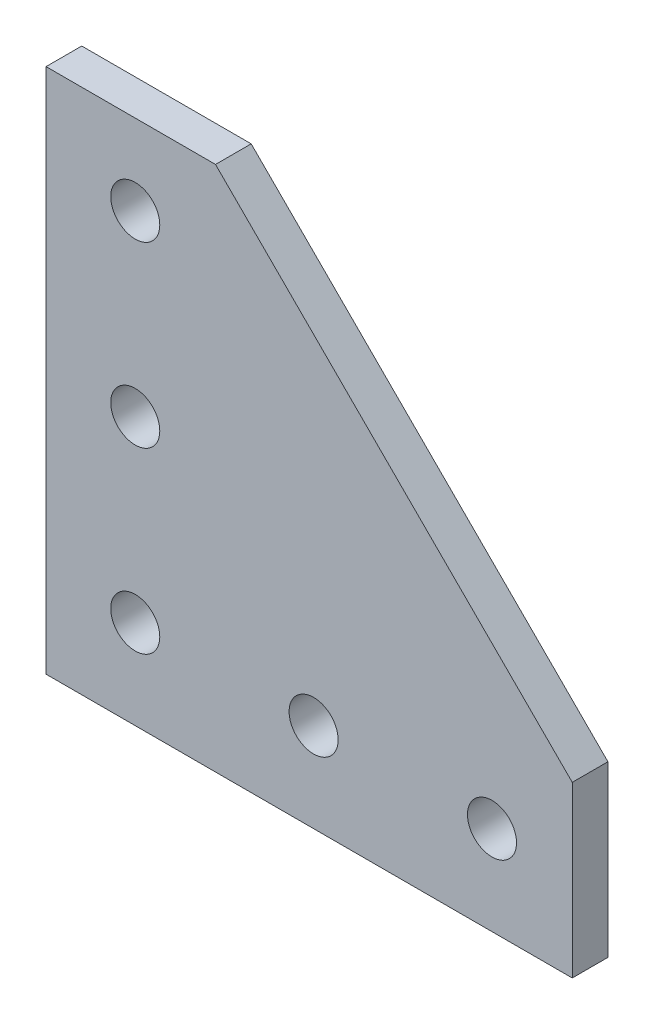
ISO-10303-21;
HEADER;
FILE_DESCRIPTION(('STEP AP214'),'2;1');
FILE_NAME('part.step','',(''),(''),'','','');
FILE_SCHEMA(('AUTOMOTIVE_DESIGN { 1 0 10303 214 1 1 1 1 }'));
ENDSEC;
DATA;
#1=APPLICATION_CONTEXT('core data for automotive mechanical design processes');
#2=APPLICATION_PROTOCOL_DEFINITION('international standard','automotive_design',2000,#1);
#3=PRODUCT_CONTEXT('',#1,'mechanical');
#4=PRODUCT('Part','Part','',(#3));
#5=PRODUCT_RELATED_PRODUCT_CATEGORY('part','',(#4));
#6=PRODUCT_DEFINITION_FORMATION('','',#4);
#7=PRODUCT_DEFINITION_CONTEXT('part definition',#1,'design');
#8=PRODUCT_DEFINITION('design','',#6,#7);
#9=PRODUCT_DEFINITION_SHAPE('','',#8);
#10=(LENGTH_UNIT() NAMED_UNIT(*) SI_UNIT(.MILLI.,.METRE.));
#11=(NAMED_UNIT(*) PLANE_ANGLE_UNIT() SI_UNIT($,.RADIAN.));
#12=(NAMED_UNIT(*) SI_UNIT($,.STERADIAN.) SOLID_ANGLE_UNIT());
#13=UNCERTAINTY_MEASURE_WITH_UNIT(LENGTH_MEASURE(1.E-05),#10,'distance_accuracy_value','');
#14=(GEOMETRIC_REPRESENTATION_CONTEXT(3) GLOBAL_UNCERTAINTY_ASSIGNED_CONTEXT((#13)) GLOBAL_UNIT_ASSIGNED_CONTEXT((#10,
#11,#12)) REPRESENTATION_CONTEXT('',''));
#15=CARTESIAN_POINT('',(0.,0.,0.));
#16=DIRECTION('',(0.,0.,1.));
#17=DIRECTION('',(1.,0.,0.));
#18=AXIS2_PLACEMENT_3D('',#15,#16,#17);
#19=CARTESIAN_POINT('',(0.,0.,2.));
#20=DIRECTION('',(0.,0.,-1.));
#21=DIRECTION('',(-1.,0.,0.));
#22=AXIS2_PLACEMENT_3D('',#19,#20,#21);
#23=PLANE('',#22);
#24=CARTESIAN_POINT('',(30.,9.99999999999999,2.));
#25=DIRECTION('',(0.,0.,1.));
#26=DIRECTION('',(1.,0.,0.));
#27=AXIS2_PLACEMENT_3D('',#24,#25,#26);
#28=CIRCLE('',#27,2.75);
#29=CARTESIAN_POINT('',(32.75,9.99999999999999,2.));
#30=VERTEX_POINT('',#29);
#31=EDGE_CURVE('E177',#30,#30,#28,.T.);
#32=ORIENTED_EDGE('',*,*,#31,.F.);
#33=EDGE_LOOP('',(#32));
#34=FACE_BOUND('',#33,.T.);
#35=CARTESIAN_POINT('',(10.,30.,2.));
#36=DIRECTION('',(0.,0.,1.));
#37=DIRECTION('',(1.,0.,0.));
#38=AXIS2_PLACEMENT_3D('',#35,#36,#37);
#39=CIRCLE('',#38,2.75);
#40=CARTESIAN_POINT('',(12.75,30.,2.));
#41=VERTEX_POINT('',#40);
#42=EDGE_CURVE('E189',#41,#41,#39,.T.);
#43=ORIENTED_EDGE('',*,*,#42,.F.);
#44=EDGE_LOOP('',(#43));
#45=FACE_BOUND('',#44,.T.);
#46=DIRECTION('',(1.,0.,0.));
#47=VECTOR('',#46,1.);
#48=CARTESIAN_POINT('',(59.,0.,2.));
#49=LINE('',#48,#47);
#50=CARTESIAN_POINT('',(0.,0.,2.));
#51=VERTEX_POINT('',#50);
#52=CARTESIAN_POINT('',(59.,0.,2.));
#53=VERTEX_POINT('',#52);
#54=EDGE_CURVE('E117',#51,#53,#49,.T.);
#55=ORIENTED_EDGE('',*,*,#54,.T.);
#56=DIRECTION('',(0.,1.,0.));
#57=VECTOR('',#56,1.);
#58=CARTESIAN_POINT('',(59.,19.,2.));
#59=LINE('',#58,#57);
#60=CARTESIAN_POINT('',(59.,19.,2.));
#61=VERTEX_POINT('',#60);
#62=EDGE_CURVE('E84',#53,#61,#59,.T.);
#63=ORIENTED_EDGE('',*,*,#62,.T.);
#64=DIRECTION('',(-0.707106781186548,0.707106781186548,0.));
#65=VECTOR('',#64,1.);
#66=CARTESIAN_POINT('',(19.,59.,2.));
#67=LINE('',#66,#65);
#68=CARTESIAN_POINT('',(19.,59.,2.));
#69=VERTEX_POINT('',#68);
#70=EDGE_CURVE('E88',#61,#69,#67,.T.);
#71=ORIENTED_EDGE('',*,*,#70,.T.);
#72=DIRECTION('',(-1.,0.,0.));
#73=VECTOR('',#72,1.);
#74=CARTESIAN_POINT('',(0.,59.,2.));
#75=LINE('',#74,#73);
#76=CARTESIAN_POINT('',(0.,59.,2.));
#77=VERTEX_POINT('',#76);
#78=EDGE_CURVE('E92',#69,#77,#75,.T.);
#79=ORIENTED_EDGE('',*,*,#78,.T.);
#80=DIRECTION('',(0.,-1.,0.));
#81=VECTOR('',#80,1.);
#82=CARTESIAN_POINT('',(0.,0.,2.));
#83=LINE('',#82,#81);
#84=EDGE_CURVE('E50',#77,#51,#83,.T.);
#85=ORIENTED_EDGE('',*,*,#84,.T.);
#86=EDGE_LOOP('',(#55,#63,#71,#79,#85));
#87=FACE_BOUND('',#86,.T.);
#88=CARTESIAN_POINT('',(10.,9.99999999999999,2.));
#89=DIRECTION('',(0.,0.,1.));
#90=DIRECTION('',(1.,0.,0.));
#91=AXIS2_PLACEMENT_3D('',#88,#89,#90);
#92=CIRCLE('',#91,2.75);
#93=CARTESIAN_POINT('',(12.75,9.99999999999999,2.));
#94=VERTEX_POINT('',#93);
#95=EDGE_CURVE('E112',#94,#94,#92,.T.);
#96=ORIENTED_EDGE('',*,*,#95,.F.);
#97=EDGE_LOOP('',(#96));
#98=FACE_BOUND('',#97,.T.);
#99=CARTESIAN_POINT('',(10.,50.,2.));
#100=DIRECTION('',(0.,0.,1.));
#101=DIRECTION('',(1.,0.,0.));
#102=AXIS2_PLACEMENT_3D('',#99,#100,#101);
#103=CIRCLE('',#102,2.75);
#104=CARTESIAN_POINT('',(12.75,50.,2.));
#105=VERTEX_POINT('',#104);
#106=EDGE_CURVE('E183',#105,#105,#103,.T.);
#107=ORIENTED_EDGE('',*,*,#106,.F.);
#108=EDGE_LOOP('',(#107));
#109=FACE_BOUND('',#108,.T.);
#110=CARTESIAN_POINT('',(50.,9.99999999999999,2.));
#111=DIRECTION('',(0.,0.,1.));
#112=DIRECTION('',(1.,0.,0.));
#113=AXIS2_PLACEMENT_3D('',#110,#111,#112);
#114=CIRCLE('',#113,2.75);
#115=CARTESIAN_POINT('',(52.75,9.99999999999999,2.));
#116=VERTEX_POINT('',#115);
#117=EDGE_CURVE('E168',#116,#116,#114,.T.);
#118=ORIENTED_EDGE('',*,*,#117,.F.);
#119=EDGE_LOOP('',(#118));
#120=FACE_BOUND('',#119,.T.);
#121=ADVANCED_FACE('F33',(#34,#45,#87,#98,#109,#120),#23,.F.);
#122=CARTESIAN_POINT('',(0.,0.,-2.));
#123=DIRECTION('',(0.,0.,-1.));
#124=DIRECTION('',(-1.,0.,0.));
#125=AXIS2_PLACEMENT_3D('',#122,#123,#124);
#126=PLANE('',#125);
#127=CARTESIAN_POINT('',(30.,9.99999999999999,-2.));
#128=DIRECTION('',(0.,0.,1.));
#129=DIRECTION('',(1.,0.,0.));
#130=AXIS2_PLACEMENT_3D('',#127,#128,#129);
#131=CIRCLE('',#130,2.75);
#132=CARTESIAN_POINT('',(32.75,9.99999999999999,-2.));
#133=VERTEX_POINT('',#132);
#134=EDGE_CURVE('E174',#133,#133,#131,.T.);
#135=ORIENTED_EDGE('',*,*,#134,.T.);
#136=EDGE_LOOP('',(#135));
#137=FACE_BOUND('',#136,.T.);
#138=CARTESIAN_POINT('',(10.,30.,-2.));
#139=DIRECTION('',(0.,0.,1.));
#140=DIRECTION('',(1.,0.,0.));
#141=AXIS2_PLACEMENT_3D('',#138,#139,#140);
#142=CIRCLE('',#141,2.75);
#143=CARTESIAN_POINT('',(12.75,30.,-2.));
#144=VERTEX_POINT('',#143);
#145=EDGE_CURVE('E186',#144,#144,#142,.T.);
#146=ORIENTED_EDGE('',*,*,#145,.T.);
#147=EDGE_LOOP('',(#146));
#148=FACE_BOUND('',#147,.T.);
#149=DIRECTION('',(1.,0.,0.));
#150=VECTOR('',#149,1.);
#151=CARTESIAN_POINT('',(59.,0.,-2.));
#152=LINE('',#151,#150);
#153=CARTESIAN_POINT('',(0.,0.,-2.));
#154=VERTEX_POINT('',#153);
#155=CARTESIAN_POINT('',(59.,0.,-2.));
#156=VERTEX_POINT('',#155);
#157=EDGE_CURVE('E108',#154,#156,#152,.T.);
#158=ORIENTED_EDGE('',*,*,#157,.F.);
#159=DIRECTION('',(0.,-1.,0.));
#160=VECTOR('',#159,1.);
#161=CARTESIAN_POINT('',(0.,0.,-2.));
#162=LINE('',#161,#160);
#163=CARTESIAN_POINT('',(0.,59.,-2.));
#164=VERTEX_POINT('',#163);
#165=EDGE_CURVE('E76',#164,#154,#162,.T.);
#166=ORIENTED_EDGE('',*,*,#165,.F.);
#167=DIRECTION('',(-1.,0.,0.));
#168=VECTOR('',#167,1.);
#169=CARTESIAN_POINT('',(0.,59.,-2.));
#170=LINE('',#169,#168);
#171=CARTESIAN_POINT('',(19.,59.,-2.));
#172=VERTEX_POINT('',#171);
#173=EDGE_CURVE('E70',#172,#164,#170,.T.);
#174=ORIENTED_EDGE('',*,*,#173,.F.);
#175=DIRECTION('',(-0.707106781186548,0.707106781186548,0.));
#176=VECTOR('',#175,1.);
#177=CARTESIAN_POINT('',(19.,59.,-2.));
#178=LINE('',#177,#176);
#179=CARTESIAN_POINT('',(59.,19.,-2.));
#180=VERTEX_POINT('',#179);
#181=EDGE_CURVE('E99',#180,#172,#178,.T.);
#182=ORIENTED_EDGE('',*,*,#181,.F.);
#183=DIRECTION('',(0.,1.,0.));
#184=VECTOR('',#183,1.);
#185=CARTESIAN_POINT('',(59.,19.,-2.));
#186=LINE('',#185,#184);
#187=EDGE_CURVE('E111',#156,#180,#186,.T.);
#188=ORIENTED_EDGE('',*,*,#187,.F.);
#189=EDGE_LOOP('',(#158,#166,#174,#182,#188));
#190=FACE_BOUND('',#189,.T.);
#191=CARTESIAN_POINT('',(10.,9.99999999999999,-2.));
#192=DIRECTION('',(0.,0.,1.));
#193=DIRECTION('',(1.,0.,0.));
#194=AXIS2_PLACEMENT_3D('',#191,#192,#193);
#195=CIRCLE('',#194,2.75);
#196=CARTESIAN_POINT('',(12.75,9.99999999999999,-2.));
#197=VERTEX_POINT('',#196);
#198=EDGE_CURVE('E192',#197,#197,#195,.T.);
#199=ORIENTED_EDGE('',*,*,#198,.T.);
#200=EDGE_LOOP('',(#199));
#201=FACE_BOUND('',#200,.T.);
#202=CARTESIAN_POINT('',(10.,50.,-2.));
#203=DIRECTION('',(0.,0.,1.));
#204=DIRECTION('',(1.,0.,0.));
#205=AXIS2_PLACEMENT_3D('',#202,#203,#204);
#206=CIRCLE('',#205,2.75);
#207=CARTESIAN_POINT('',(12.75,50.,-2.));
#208=VERTEX_POINT('',#207);
#209=EDGE_CURVE('E180',#208,#208,#206,.T.);
#210=ORIENTED_EDGE('',*,*,#209,.T.);
#211=EDGE_LOOP('',(#210));
#212=FACE_BOUND('',#211,.T.);
#213=CARTESIAN_POINT('',(50.,9.99999999999999,-2.));
#214=DIRECTION('',(0.,0.,1.));
#215=DIRECTION('',(1.,0.,0.));
#216=AXIS2_PLACEMENT_3D('',#213,#214,#215);
#217=CIRCLE('',#216,2.75);
#218=CARTESIAN_POINT('',(52.75,9.99999999999999,-2.));
#219=VERTEX_POINT('',#218);
#220=EDGE_CURVE('E171',#219,#219,#217,.T.);
#221=ORIENTED_EDGE('',*,*,#220,.T.);
#222=EDGE_LOOP('',(#221));
#223=FACE_BOUND('',#222,.T.);
#224=ADVANCED_FACE('F121',(#137,#148,#190,#201,#212,#223),#126,.T.);
#225=CARTESIAN_POINT('',(59.,0.,2.));
#226=DIRECTION('',(0.,1.,0.));
#227=DIRECTION('',(-1.,0.,0.));
#228=AXIS2_PLACEMENT_3D('',#225,#226,#227);
#229=PLANE('',#228);
#230=ORIENTED_EDGE('',*,*,#157,.T.);
#231=DIRECTION('',(0.,0.,-1.));
#232=VECTOR('',#231,1.);
#233=CARTESIAN_POINT('',(59.,0.,2.));
#234=LINE('',#233,#232);
#235=EDGE_CURVE('E11',#53,#156,#234,.T.);
#236=ORIENTED_EDGE('',*,*,#235,.F.);
#237=ORIENTED_EDGE('',*,*,#54,.F.);
#238=DIRECTION('',(0.,0.,-1.));
#239=VECTOR('',#238,1.);
#240=CARTESIAN_POINT('',(0.,0.,2.));
#241=LINE('',#240,#239);
#242=EDGE_CURVE('E104',#51,#154,#241,.T.);
#243=ORIENTED_EDGE('',*,*,#242,.T.);
#244=EDGE_LOOP('',(#230,#236,#237,#243));
#245=FACE_BOUND('',#244,.T.);
#246=ADVANCED_FACE('F35',(#245),#229,.F.);
#247=CARTESIAN_POINT('',(59.,19.,2.));
#248=DIRECTION('',(-1.,0.,0.));
#249=DIRECTION('',(0.,0.,1.));
#250=AXIS2_PLACEMENT_3D('',#247,#248,#249);
#251=PLANE('',#250);
#252=ORIENTED_EDGE('',*,*,#187,.T.);
#253=DIRECTION('',(0.,0.,-1.));
#254=VECTOR('',#253,1.);
#255=CARTESIAN_POINT('',(59.,19.,2.));
#256=LINE('',#255,#254);
#257=EDGE_CURVE('E42',#61,#180,#256,.T.);
#258=ORIENTED_EDGE('',*,*,#257,.F.);
#259=ORIENTED_EDGE('',*,*,#62,.F.);
#260=ORIENTED_EDGE('',*,*,#235,.T.);
#261=EDGE_LOOP('',(#252,#258,#259,#260));
#262=FACE_BOUND('',#261,.T.);
#263=ADVANCED_FACE('F249',(#262),#251,.F.);
#264=CARTESIAN_POINT('',(19.,59.,2.));
#265=DIRECTION('',(-0.707106781186547,-0.707106781186547,0.));
#266=DIRECTION('',(0.707106781186548,-0.707106781186548,0.));
#267=AXIS2_PLACEMENT_3D('',#264,#265,#266);
#268=PLANE('',#267);
#269=ORIENTED_EDGE('',*,*,#181,.T.);
#270=DIRECTION('',(0.,0.,-1.));
#271=VECTOR('',#270,1.);
#272=CARTESIAN_POINT('',(19.,59.,2.));
#273=LINE('',#272,#271);
#274=EDGE_CURVE('E96',#69,#172,#273,.T.);
#275=ORIENTED_EDGE('',*,*,#274,.F.);
#276=ORIENTED_EDGE('',*,*,#70,.F.);
#277=ORIENTED_EDGE('',*,*,#257,.T.);
#278=EDGE_LOOP('',(#269,#275,#276,#277));
#279=FACE_BOUND('',#278,.T.);
#280=ADVANCED_FACE('F97',(#279),#268,.F.);
#281=CARTESIAN_POINT('',(0.,59.,2.));
#282=DIRECTION('',(0.,-1.,0.));
#283=DIRECTION('',(0.,0.,-1.));
#284=AXIS2_PLACEMENT_3D('',#281,#282,#283);
#285=PLANE('',#284);
#286=ORIENTED_EDGE('',*,*,#173,.T.);
#287=DIRECTION('',(0.,0.,-1.));
#288=VECTOR('',#287,1.);
#289=CARTESIAN_POINT('',(0.,59.,2.));
#290=LINE('',#289,#288);
#291=EDGE_CURVE('E100',#77,#164,#290,.T.);
#292=ORIENTED_EDGE('',*,*,#291,.F.);
#293=ORIENTED_EDGE('',*,*,#78,.F.);
#294=ORIENTED_EDGE('',*,*,#274,.T.);
#295=EDGE_LOOP('',(#286,#292,#293,#294));
#296=FACE_BOUND('',#295,.T.);
#297=ADVANCED_FACE('F102',(#296),#285,.F.);
#298=CARTESIAN_POINT('',(0.,0.,2.));
#299=DIRECTION('',(1.,0.,0.));
#300=DIRECTION('',(0.,0.,-1.));
#301=AXIS2_PLACEMENT_3D('',#298,#299,#300);
#302=PLANE('',#301);
#303=ORIENTED_EDGE('',*,*,#165,.T.);
#304=ORIENTED_EDGE('',*,*,#242,.F.);
#305=ORIENTED_EDGE('',*,*,#84,.F.);
#306=ORIENTED_EDGE('',*,*,#291,.T.);
#307=EDGE_LOOP('',(#303,#304,#305,#306));
#308=FACE_BOUND('',#307,.T.);
#309=ADVANCED_FACE('F126',(#308),#302,.F.);
#310=CARTESIAN_POINT('',(10.,9.99999999999999,2.));
#311=DIRECTION('',(0.,0.,-1.));
#312=DIRECTION('',(-1.,0.,0.));
#313=AXIS2_PLACEMENT_3D('',#310,#311,#312);
#314=CYLINDRICAL_SURFACE('',#313,2.75);
#315=ORIENTED_EDGE('',*,*,#95,.T.);
#316=EDGE_LOOP('',(#315));
#317=FACE_BOUND('',#316,.T.);
#318=ORIENTED_EDGE('',*,*,#198,.F.);
#319=EDGE_LOOP('',(#318));
#320=FACE_BOUND('',#319,.T.);
#321=ADVANCED_FACE('F128',(#317,#320),#314,.F.);
#322=CARTESIAN_POINT('',(10.,30.,2.));
#323=DIRECTION('',(0.,0.,-1.));
#324=DIRECTION('',(-1.,0.,0.));
#325=AXIS2_PLACEMENT_3D('',#322,#323,#324);
#326=CYLINDRICAL_SURFACE('',#325,2.75);
#327=ORIENTED_EDGE('',*,*,#42,.T.);
#328=EDGE_LOOP('',(#327));
#329=FACE_BOUND('',#328,.T.);
#330=ORIENTED_EDGE('',*,*,#145,.F.);
#331=EDGE_LOOP('',(#330));
#332=FACE_BOUND('',#331,.T.);
#333=ADVANCED_FACE('F134',(#329,#332),#326,.F.);
#334=CARTESIAN_POINT('',(10.,50.,2.));
#335=DIRECTION('',(0.,0.,-1.));
#336=DIRECTION('',(-1.,0.,0.));
#337=AXIS2_PLACEMENT_3D('',#334,#335,#336);
#338=CYLINDRICAL_SURFACE('',#337,2.75);
#339=ORIENTED_EDGE('',*,*,#106,.T.);
#340=EDGE_LOOP('',(#339));
#341=FACE_BOUND('',#340,.T.);
#342=ORIENTED_EDGE('',*,*,#209,.F.);
#343=EDGE_LOOP('',(#342));
#344=FACE_BOUND('',#343,.T.);
#345=ADVANCED_FACE('F151',(#341,#344),#338,.F.);
#346=CARTESIAN_POINT('',(30.,9.99999999999999,2.));
#347=DIRECTION('',(0.,0.,-1.));
#348=DIRECTION('',(-1.,0.,0.));
#349=AXIS2_PLACEMENT_3D('',#346,#347,#348);
#350=CYLINDRICAL_SURFACE('',#349,2.75);
#351=ORIENTED_EDGE('',*,*,#31,.T.);
#352=EDGE_LOOP('',(#351));
#353=FACE_BOUND('',#352,.T.);
#354=ORIENTED_EDGE('',*,*,#134,.F.);
#355=EDGE_LOOP('',(#354));
#356=FACE_BOUND('',#355,.T.);
#357=ADVANCED_FACE('F155',(#353,#356),#350,.F.);
#358=CARTESIAN_POINT('',(50.,9.99999999999999,2.));
#359=DIRECTION('',(0.,0.,-1.));
#360=DIRECTION('',(-1.,0.,0.));
#361=AXIS2_PLACEMENT_3D('',#358,#359,#360);
#362=CYLINDRICAL_SURFACE('',#361,2.75);
#363=ORIENTED_EDGE('',*,*,#117,.T.);
#364=EDGE_LOOP('',(#363));
#365=FACE_BOUND('',#364,.T.);
#366=ORIENTED_EDGE('',*,*,#220,.F.);
#367=EDGE_LOOP('',(#366));
#368=FACE_BOUND('',#367,.T.);
#369=ADVANCED_FACE('F159',(#365,#368),#362,.F.);
#370=CLOSED_SHELL('',(#121,#224,#246,#263,#280,#297,#309,#321,#333,#345,#357,#369));
#371=MANIFOLD_SOLID_BREP('B2',#370);
#372=ADVANCED_BREP_SHAPE_REPRESENTATION('',(#18,#371),#14);
#373=SHAPE_DEFINITION_REPRESENTATION(#9,#372);
ENDSEC;
END-ISO-10303-21;
